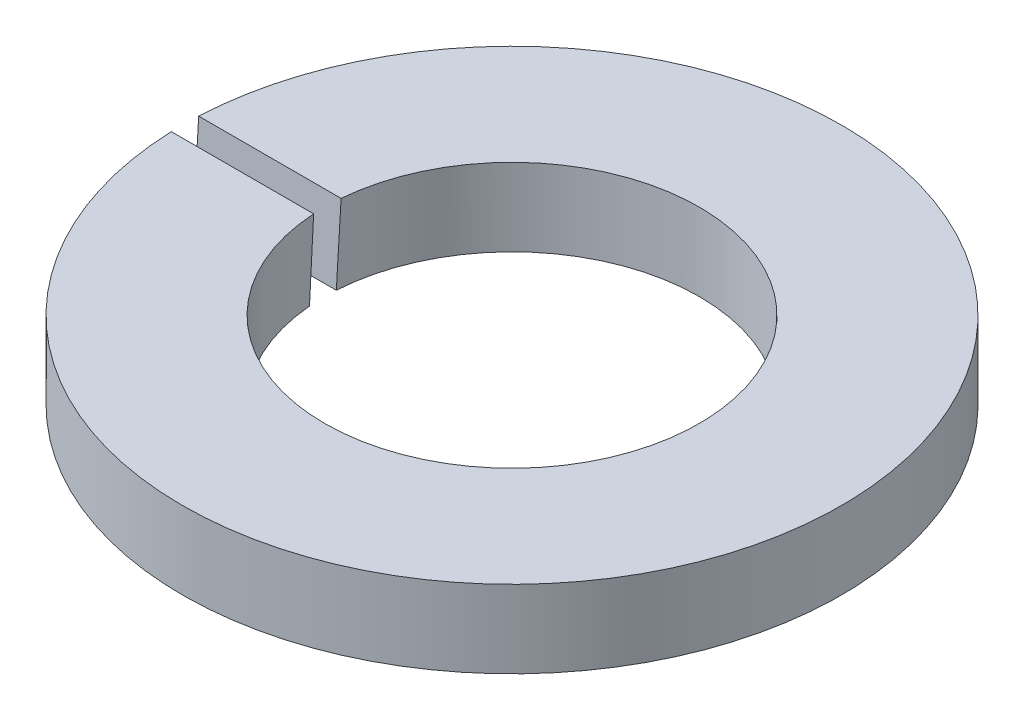
ISO-10303-21;
HEADER;
FILE_DESCRIPTION(('STEP AP214'),'2;1');
FILE_NAME('part.step','',(''),(''),'','','');
FILE_SCHEMA(('AUTOMOTIVE_DESIGN { 1 0 10303 214 1 1 1 1 }'));
ENDSEC;
DATA;
#1=APPLICATION_CONTEXT('core data for automotive mechanical design processes');
#2=APPLICATION_PROTOCOL_DEFINITION('international standard','automotive_design',2000,#1);
#3=PRODUCT_CONTEXT('',#1,'mechanical');
#4=PRODUCT('Part','Part','',(#3));
#5=PRODUCT_RELATED_PRODUCT_CATEGORY('part','',(#4));
#6=PRODUCT_DEFINITION_FORMATION('','',#4);
#7=PRODUCT_DEFINITION_CONTEXT('part definition',#1,'design');
#8=PRODUCT_DEFINITION('design','',#6,#7);
#9=PRODUCT_DEFINITION_SHAPE('','',#8);
#10=(LENGTH_UNIT() NAMED_UNIT(*) SI_UNIT(.MILLI.,.METRE.));
#11=(NAMED_UNIT(*) PLANE_ANGLE_UNIT() SI_UNIT($,.RADIAN.));
#12=(NAMED_UNIT(*) SI_UNIT($,.STERADIAN.) SOLID_ANGLE_UNIT());
#13=UNCERTAINTY_MEASURE_WITH_UNIT(LENGTH_MEASURE(1.E-05),#10,'distance_accuracy_value','');
#14=(GEOMETRIC_REPRESENTATION_CONTEXT(3) GLOBAL_UNCERTAINTY_ASSIGNED_CONTEXT((#13)) GLOBAL_UNIT_ASSIGNED_CONTEXT((#10,
#11,#12)) REPRESENTATION_CONTEXT('',''));
#15=CARTESIAN_POINT('',(0.,0.,0.));
#16=DIRECTION('',(0.,0.,1.));
#17=DIRECTION('',(1.,0.,0.));
#18=AXIS2_PLACEMENT_3D('',#15,#16,#17);
#19=CARTESIAN_POINT('',(38.0024692483418,9.4,-53.0011541762027));
#20=DIRECTION('',(0.,-1.,0.));
#21=DIRECTION('',(0.,0.,1.));
#22=AXIS2_PLACEMENT_3D('',#19,#20,#21);
#23=PLANE('',#22);
#24=DIRECTION('',(-1.,0.,0.));
#25=VECTOR('',#24,1.);
#26=CARTESIAN_POINT('',(33.403337910365,9.4,-50.48769230769));
#27=LINE('',#26,#25);
#28=CARTESIAN_POINT('',(33.9526541328445,9.4,-50.48769230769));
#29=VERTEX_POINT('',#28);
#30=CARTESIAN_POINT('',(32.851508277594,9.4,-50.48769230769));
#31=VERTEX_POINT('',#30);
#32=EDGE_CURVE('E74',#29,#31,#27,.T.);
#33=ORIENTED_EDGE('',*,*,#32,.T.);
#34=CARTESIAN_POINT('',(35.4,9.4,-50.4));
#35=DIRECTION('',(0.,-1.,0.));
#36=DIRECTION('',(1.,0.,0.));
#37=AXIS2_PLACEMENT_3D('',#34,#35,#36);
#38=CIRCLE('',#37,2.55);
#39=CARTESIAN_POINT('',(32.852934859804,9.4,-50.27769230769));
#40=VERTEX_POINT('',#39);
#41=EDGE_CURVE('E65',#31,#40,#38,.T.);
#42=ORIENTED_EDGE('',*,*,#41,.T.);
#43=DIRECTION('',(1.,0.,0.));
#44=VECTOR('',#43,1.);
#45=CARTESIAN_POINT('',(33.403337910365,9.4,-50.27769230769));
#46=LINE('',#45,#44);
#47=CARTESIAN_POINT('',(33.955167543138,9.4,-50.27769230769));
#48=VERTEX_POINT('',#47);
#49=EDGE_CURVE('E62',#40,#48,#46,.T.);
#50=ORIENTED_EDGE('',*,*,#49,.T.);
#51=CARTESIAN_POINT('',(35.4,9.4,-50.4));
#52=DIRECTION('',(0.,-1.,0.));
#53=DIRECTION('',(1.,0.,0.));
#54=AXIS2_PLACEMENT_3D('',#51,#52,#53);
#55=CIRCLE('',#54,1.45000000000001);
#56=EDGE_CURVE('E20',#29,#48,#55,.T.);
#57=ORIENTED_EDGE('',*,*,#56,.F.);
#58=EDGE_LOOP('',(#33,#42,#50,#57));
#59=FACE_BOUND('',#58,.T.);
#60=ADVANCED_FACE('F16',(#59),#23,.T.);
#61=CARTESIAN_POINT('',(32.85150827759,10.,-50.31230769231));
#62=DIRECTION('',(0.,0.0575965351043424,0.998339941675166));
#63=DIRECTION('',(0.,-0.998339941675166,0.0575965351043424));
#64=AXIS2_PLACEMENT_3D('',#61,#62,#63);
#65=PLANE('',#64);
#66=ORIENTED_EDGE('',*,*,#49,.F.);
#67=CARTESIAN_POINT('',(35.4,11.5199999997567,-50.4));
#68=DIRECTION('',(0.,0.0575965351043424,0.998339941675166));
#69=DIRECTION('',(0.,-0.998339941675166,0.0575965351043424));
#70=AXIS2_PLACEMENT_3D('',#67,#68,#69);
#71=ELLIPSE('',#70,44.2734965806605,2.55);
#72=CARTESIAN_POINT('',(32.851508277594,10.,-50.3123076923091));
#73=VERTEX_POINT('',#72);
#74=EDGE_CURVE('E79',#40,#73,#71,.F.);
#75=ORIENTED_EDGE('',*,*,#74,.T.);
#76=DIRECTION('',(1.,0.,0.));
#77=VECTOR('',#76,1.);
#78=CARTESIAN_POINT('',(35.4269670096111,10.,-50.3123076923081));
#79=LINE('',#78,#77);
#80=CARTESIAN_POINT('',(33.9526541328446,10.,-50.3123076923091));
#81=VERTEX_POINT('',#80);
#82=EDGE_CURVE('E73',#73,#81,#79,.T.);
#83=ORIENTED_EDGE('',*,*,#82,.T.);
#84=CARTESIAN_POINT('',(35.4,11.5199999997567,-50.4));
#85=DIRECTION('',(0.,0.0575965351043424,0.998339941675166));
#86=DIRECTION('',(0.,-0.998339941675166,0.0575965351043424));
#87=AXIS2_PLACEMENT_3D('',#84,#85,#86);
#88=ELLIPSE('',#87,25.1751255066503,1.45000000000001);
#89=EDGE_CURVE('E59',#48,#81,#88,.F.);
#90=ORIENTED_EDGE('',*,*,#89,.F.);
#91=EDGE_LOOP('',(#66,#75,#83,#90));
#92=FACE_BOUND('',#91,.T.);
#93=ADVANCED_FACE('F71',(#92),#65,.F.);
#94=CARTESIAN_POINT('',(35.4,10.,-50.4));
#95=DIRECTION('',(0.,-1.,0.));
#96=DIRECTION('',(1.,0.,0.));
#97=AXIS2_PLACEMENT_3D('',#94,#95,#96);
#98=CYLINDRICAL_SURFACE('',#97,1.45000000000001);
#99=CARTESIAN_POINT('',(35.4,10.,-50.4));
#100=DIRECTION('',(0.,-1.,0.));
#101=DIRECTION('',(1.,0.,0.));
#102=AXIS2_PLACEMENT_3D('',#99,#100,#101);
#103=CIRCLE('',#102,1.45000000000001);
#104=CARTESIAN_POINT('',(33.955167543138,10.,-50.5223076923092));
#105=VERTEX_POINT('',#104);
#106=EDGE_CURVE('E81',#81,#105,#103,.F.);
#107=ORIENTED_EDGE('',*,*,#106,.T.);
#108=CARTESIAN_POINT('',(35.4,7.88000000024214,-50.4));
#109=DIRECTION('',(0.,-0.0575965351043079,-0.998339941675168));
#110=DIRECTION('',(0.,-0.998339941675168,0.0575965351043078));
#111=AXIS2_PLACEMENT_3D('',#108,#109,#110);
#112=ELLIPSE('',#111,25.1751255066654,1.45000000000001);
#113=EDGE_CURVE('E61',#105,#29,#112,.F.);
#114=ORIENTED_EDGE('',*,*,#113,.T.);
#115=ORIENTED_EDGE('',*,*,#56,.T.);
#116=ORIENTED_EDGE('',*,*,#89,.T.);
#117=EDGE_LOOP('',(#107,#114,#115,#116));
#118=FACE_BOUND('',#117,.T.);
#119=ADVANCED_FACE('F57',(#118),#98,.F.);
#120=CARTESIAN_POINT('',(32.85150827759,9.4,-50.48769230769));
#121=DIRECTION('',(0.,-0.0575965351043079,-0.998339941675168));
#122=DIRECTION('',(0.,0.998339941675168,-0.0575965351043079));
#123=AXIS2_PLACEMENT_3D('',#120,#121,#122);
#124=PLANE('',#123);
#125=ORIENTED_EDGE('',*,*,#32,.F.);
#126=ORIENTED_EDGE('',*,*,#113,.F.);
#127=DIRECTION('',(-1.,0.,0.));
#128=VECTOR('',#127,1.);
#129=CARTESIAN_POINT('',(35.4269670096111,10.,-50.5223076923083));
#130=LINE('',#129,#128);
#131=CARTESIAN_POINT('',(32.8529348598039,10.,-50.5223076923092));
#132=VERTEX_POINT('',#131);
#133=EDGE_CURVE('E26',#105,#132,#130,.T.);
#134=ORIENTED_EDGE('',*,*,#133,.T.);
#135=CARTESIAN_POINT('',(35.4,7.88000000024214,-50.4));
#136=DIRECTION('',(0.,-0.0575965351043079,-0.998339941675168));
#137=DIRECTION('',(0.,-0.998339941675168,0.0575965351043078));
#138=AXIS2_PLACEMENT_3D('',#135,#136,#137);
#139=ELLIPSE('',#138,44.2734965806871,2.55);
#140=EDGE_CURVE('E34',#132,#31,#139,.F.);
#141=ORIENTED_EDGE('',*,*,#140,.T.);
#142=EDGE_LOOP('',(#125,#126,#134,#141));
#143=FACE_BOUND('',#142,.T.);
#144=ADVANCED_FACE('F88',(#143),#124,.F.);
#145=CARTESIAN_POINT('',(35.4,10.,-50.4));
#146=DIRECTION('',(0.,-1.,0.));
#147=DIRECTION('',(1.,0.,0.));
#148=AXIS2_PLACEMENT_3D('',#145,#146,#147);
#149=CYLINDRICAL_SURFACE('',#148,2.55);
#150=ORIENTED_EDGE('',*,*,#41,.F.);
#151=ORIENTED_EDGE('',*,*,#140,.F.);
#152=CARTESIAN_POINT('',(35.4,10.,-50.4));
#153=DIRECTION('',(0.,-1.,0.));
#154=DIRECTION('',(1.,0.,0.));
#155=AXIS2_PLACEMENT_3D('',#152,#153,#154);
#156=CIRCLE('',#155,2.55);
#157=EDGE_CURVE('E10',#132,#73,#156,.T.);
#158=ORIENTED_EDGE('',*,*,#157,.T.);
#159=ORIENTED_EDGE('',*,*,#74,.F.);
#160=EDGE_LOOP('',(#150,#151,#158,#159));
#161=FACE_BOUND('',#160,.T.);
#162=ADVANCED_FACE('F90',(#161),#149,.T.);
#163=CARTESIAN_POINT('',(38.0024257416323,10.,-53.0010187227932));
#164=DIRECTION('',(0.,-1.,0.));
#165=DIRECTION('',(0.,0.,1.));
#166=AXIS2_PLACEMENT_3D('',#163,#164,#165);
#167=PLANE('',#166);
#168=ORIENTED_EDGE('',*,*,#133,.F.);
#169=ORIENTED_EDGE('',*,*,#106,.F.);
#170=ORIENTED_EDGE('',*,*,#82,.F.);
#171=ORIENTED_EDGE('',*,*,#157,.F.);
#172=EDGE_LOOP('',(#168,#169,#170,#171));
#173=FACE_BOUND('',#172,.T.);
#174=ADVANCED_FACE('F18',(#173),#167,.F.);
#175=CLOSED_SHELL('',(#60,#93,#119,#144,#162,#174));
#176=MANIFOLD_SOLID_BREP('B1',#175);
#177=ADVANCED_BREP_SHAPE_REPRESENTATION('',(#18,#176),#14);
#178=SHAPE_DEFINITION_REPRESENTATION(#9,#177);
ENDSEC;
END-ISO-10303-21;
